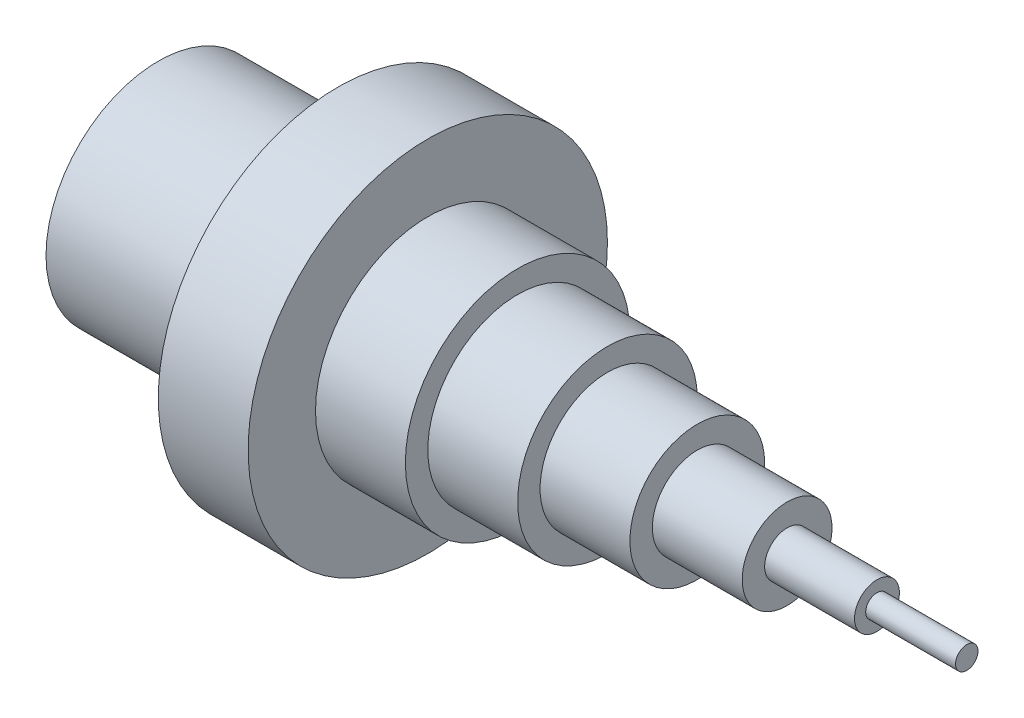
ISO-10303-21;
HEADER;
FILE_DESCRIPTION(('STEP AP214'),'2;1');
FILE_NAME('part.step','',(''),(''),'','','');
FILE_SCHEMA(('AUTOMOTIVE_DESIGN { 1 0 10303 214 1 1 1 1 }'));
ENDSEC;
DATA;
#1=APPLICATION_CONTEXT('core data for automotive mechanical design processes');
#2=APPLICATION_PROTOCOL_DEFINITION('international standard','automotive_design',2000,#1);
#3=PRODUCT_CONTEXT('',#1,'mechanical');
#4=PRODUCT('Part','Part','',(#3));
#5=PRODUCT_RELATED_PRODUCT_CATEGORY('part','',(#4));
#6=PRODUCT_DEFINITION_FORMATION('','',#4);
#7=PRODUCT_DEFINITION_CONTEXT('part definition',#1,'design');
#8=PRODUCT_DEFINITION('design','',#6,#7);
#9=PRODUCT_DEFINITION_SHAPE('','',#8);
#10=(LENGTH_UNIT() NAMED_UNIT(*) SI_UNIT(.MILLI.,.METRE.));
#11=(NAMED_UNIT(*) PLANE_ANGLE_UNIT() SI_UNIT($,.RADIAN.));
#12=(NAMED_UNIT(*) SI_UNIT($,.STERADIAN.) SOLID_ANGLE_UNIT());
#13=UNCERTAINTY_MEASURE_WITH_UNIT(LENGTH_MEASURE(1.E-05),#10,'distance_accuracy_value','');
#14=(GEOMETRIC_REPRESENTATION_CONTEXT(3) GLOBAL_UNCERTAINTY_ASSIGNED_CONTEXT((#13)) GLOBAL_UNIT_ASSIGNED_CONTEXT((#10,
#11,#12)) REPRESENTATION_CONTEXT('',''));
#15=CARTESIAN_POINT('',(0.,0.,0.));
#16=DIRECTION('',(0.,0.,1.));
#17=DIRECTION('',(1.,0.,0.));
#18=AXIS2_PLACEMENT_3D('',#15,#16,#17);
#19=CARTESIAN_POINT('',(-180.,0.,0.));
#20=DIRECTION('',(-1.,0.,0.));
#21=DIRECTION('',(0.,0.,1.));
#22=AXIS2_PLACEMENT_3D('',#19,#20,#21);
#23=PLANE('',#22);
#24=CARTESIAN_POINT('',(-180.,0.,0.));
#25=DIRECTION('',(1.,0.,0.));
#26=DIRECTION('',(0.,0.,-1.));
#27=AXIS2_PLACEMENT_3D('',#24,#25,#26);
#28=CIRCLE('',#27,25.);
#29=CARTESIAN_POINT('',(-180.,0.,-25.));
#30=VERTEX_POINT('',#29);
#31=EDGE_CURVE('E83',#30,#30,#28,.T.);
#32=ORIENTED_EDGE('',*,*,#31,.F.);
#33=EDGE_LOOP('',(#32));
#34=FACE_BOUND('',#33,.T.);
#35=ADVANCED_FACE('F31',(#34),#23,.T.);
#36=CARTESIAN_POINT('',(0.,0.,0.));
#37=DIRECTION('',(1.,0.,0.));
#38=DIRECTION('',(0.,0.,-1.));
#39=AXIS2_PLACEMENT_3D('',#36,#37,#38);
#40=PLANE('',#39);
#41=CARTESIAN_POINT('',(0.,0.,0.));
#42=DIRECTION('',(1.,0.,0.));
#43=DIRECTION('',(0.,0.,-1.));
#44=AXIS2_PLACEMENT_3D('',#41,#42,#43);
#45=CIRCLE('',#44,2.5);
#46=CARTESIAN_POINT('',(0.,0.,-2.5));
#47=VERTEX_POINT('',#46);
#48=EDGE_CURVE('E10',#47,#47,#45,.T.);
#49=ORIENTED_EDGE('',*,*,#48,.T.);
#50=EDGE_LOOP('',(#49));
#51=FACE_BOUND('',#50,.T.);
#52=ADVANCED_FACE('F91',(#51),#40,.T.);
#53=CARTESIAN_POINT('',(0.,0.,0.));
#54=DIRECTION('',(1.,0.,0.));
#55=DIRECTION('',(0.,0.,-1.));
#56=AXIS2_PLACEMENT_3D('',#53,#54,#55);
#57=CYLINDRICAL_SURFACE('',#56,2.5);
#58=CARTESIAN_POINT('',(-20.,0.,0.));
#59=DIRECTION('',(1.,0.,0.));
#60=DIRECTION('',(0.,0.,-1.));
#61=AXIS2_PLACEMENT_3D('',#58,#59,#60);
#62=CIRCLE('',#61,2.5);
#63=CARTESIAN_POINT('',(-20.,0.,-2.5));
#64=VERTEX_POINT('',#63);
#65=EDGE_CURVE('E37',#64,#64,#62,.T.);
#66=ORIENTED_EDGE('',*,*,#65,.T.);
#67=EDGE_LOOP('',(#66));
#68=FACE_BOUND('',#67,.T.);
#69=ORIENTED_EDGE('',*,*,#48,.F.);
#70=EDGE_LOOP('',(#69));
#71=FACE_BOUND('',#70,.T.);
#72=ADVANCED_FACE('F95',(#68,#71),#57,.T.);
#73=CARTESIAN_POINT('',(-20.,0.,0.));
#74=DIRECTION('',(1.,0.,0.));
#75=DIRECTION('',(0.,0.,-1.));
#76=AXIS2_PLACEMENT_3D('',#73,#74,#75);
#77=PLANE('',#76);
#78=CARTESIAN_POINT('',(-20.,0.,0.));
#79=DIRECTION('',(1.,0.,0.));
#80=DIRECTION('',(0.,0.,-1.));
#81=AXIS2_PLACEMENT_3D('',#78,#79,#80);
#82=CIRCLE('',#81,5.);
#83=CARTESIAN_POINT('',(-20.,0.,-5.));
#84=VERTEX_POINT('',#83);
#85=EDGE_CURVE('E41',#84,#84,#82,.T.);
#86=ORIENTED_EDGE('',*,*,#85,.T.);
#87=EDGE_LOOP('',(#86));
#88=FACE_BOUND('',#87,.T.);
#89=ORIENTED_EDGE('',*,*,#65,.F.);
#90=EDGE_LOOP('',(#89));
#91=FACE_BOUND('',#90,.T.);
#92=ADVANCED_FACE('F99',(#88,#91),#77,.T.);
#93=CARTESIAN_POINT('',(0.,0.,0.));
#94=DIRECTION('',(1.,0.,0.));
#95=DIRECTION('',(0.,0.,-1.));
#96=AXIS2_PLACEMENT_3D('',#93,#94,#95);
#97=CYLINDRICAL_SURFACE('',#96,5.);
#98=CARTESIAN_POINT('',(-40.,0.,0.));
#99=DIRECTION('',(1.,0.,0.));
#100=DIRECTION('',(0.,0.,-1.));
#101=AXIS2_PLACEMENT_3D('',#98,#99,#100);
#102=CIRCLE('',#101,5.);
#103=CARTESIAN_POINT('',(-40.,0.,-5.));
#104=VERTEX_POINT('',#103);
#105=EDGE_CURVE('E45',#104,#104,#102,.T.);
#106=ORIENTED_EDGE('',*,*,#105,.T.);
#107=EDGE_LOOP('',(#106));
#108=FACE_BOUND('',#107,.T.);
#109=ORIENTED_EDGE('',*,*,#85,.F.);
#110=EDGE_LOOP('',(#109));
#111=FACE_BOUND('',#110,.T.);
#112=ADVANCED_FACE('F104',(#108,#111),#97,.T.);
#113=CARTESIAN_POINT('',(-40.,0.,0.));
#114=DIRECTION('',(1.,0.,0.));
#115=DIRECTION('',(0.,0.,-1.));
#116=AXIS2_PLACEMENT_3D('',#113,#114,#115);
#117=PLANE('',#116);
#118=CARTESIAN_POINT('',(-40.,0.,0.));
#119=DIRECTION('',(1.,0.,0.));
#120=DIRECTION('',(0.,0.,-1.));
#121=AXIS2_PLACEMENT_3D('',#118,#119,#120);
#122=CIRCLE('',#121,9.99999999999999);
#123=CARTESIAN_POINT('',(-40.,0.,-9.99999999999999));
#124=VERTEX_POINT('',#123);
#125=EDGE_CURVE('E50',#124,#124,#122,.T.);
#126=ORIENTED_EDGE('',*,*,#125,.T.);
#127=EDGE_LOOP('',(#126));
#128=FACE_BOUND('',#127,.T.);
#129=ORIENTED_EDGE('',*,*,#105,.F.);
#130=EDGE_LOOP('',(#129));
#131=FACE_BOUND('',#130,.T.);
#132=ADVANCED_FACE('F108',(#128,#131),#117,.T.);
#133=CARTESIAN_POINT('',(0.,0.,0.));
#134=DIRECTION('',(1.,0.,0.));
#135=DIRECTION('',(0.,0.,-1.));
#136=AXIS2_PLACEMENT_3D('',#133,#134,#135);
#137=CYLINDRICAL_SURFACE('',#136,9.99999999999999);
#138=CARTESIAN_POINT('',(-60.,0.,0.));
#139=DIRECTION('',(1.,0.,0.));
#140=DIRECTION('',(0.,0.,-1.));
#141=AXIS2_PLACEMENT_3D('',#138,#139,#140);
#142=CIRCLE('',#141,9.99999999999999);
#143=CARTESIAN_POINT('',(-60.,0.,-9.99999999999999));
#144=VERTEX_POINT('',#143);
#145=EDGE_CURVE('E53',#144,#144,#142,.T.);
#146=ORIENTED_EDGE('',*,*,#145,.T.);
#147=EDGE_LOOP('',(#146));
#148=FACE_BOUND('',#147,.T.);
#149=ORIENTED_EDGE('',*,*,#125,.F.);
#150=EDGE_LOOP('',(#149));
#151=FACE_BOUND('',#150,.T.);
#152=ADVANCED_FACE('F112',(#148,#151),#137,.T.);
#153=CARTESIAN_POINT('',(-60.,0.,0.));
#154=DIRECTION('',(1.,0.,0.));
#155=DIRECTION('',(0.,0.,-1.));
#156=AXIS2_PLACEMENT_3D('',#153,#154,#155);
#157=PLANE('',#156);
#158=CARTESIAN_POINT('',(-60.,0.,0.));
#159=DIRECTION('',(1.,0.,0.));
#160=DIRECTION('',(0.,0.,-1.));
#161=AXIS2_PLACEMENT_3D('',#158,#159,#160);
#162=CIRCLE('',#161,15.);
#163=CARTESIAN_POINT('',(-60.,0.,-15.));
#164=VERTEX_POINT('',#163);
#165=EDGE_CURVE('E56',#164,#164,#162,.T.);
#166=ORIENTED_EDGE('',*,*,#165,.T.);
#167=EDGE_LOOP('',(#166));
#168=FACE_BOUND('',#167,.T.);
#169=ORIENTED_EDGE('',*,*,#145,.F.);
#170=EDGE_LOOP('',(#169));
#171=FACE_BOUND('',#170,.T.);
#172=ADVANCED_FACE('F116',(#168,#171),#157,.T.);
#173=CARTESIAN_POINT('',(0.,0.,0.));
#174=DIRECTION('',(1.,0.,0.));
#175=DIRECTION('',(0.,0.,-1.));
#176=AXIS2_PLACEMENT_3D('',#173,#174,#175);
#177=CYLINDRICAL_SURFACE('',#176,15.);
#178=CARTESIAN_POINT('',(-80.,0.,0.));
#179=DIRECTION('',(1.,0.,0.));
#180=DIRECTION('',(0.,0.,-1.));
#181=AXIS2_PLACEMENT_3D('',#178,#179,#180);
#182=CIRCLE('',#181,15.);
#183=CARTESIAN_POINT('',(-80.,0.,-15.));
#184=VERTEX_POINT('',#183);
#185=EDGE_CURVE('E59',#184,#184,#182,.T.);
#186=ORIENTED_EDGE('',*,*,#185,.T.);
#187=EDGE_LOOP('',(#186));
#188=FACE_BOUND('',#187,.T.);
#189=ORIENTED_EDGE('',*,*,#165,.F.);
#190=EDGE_LOOP('',(#189));
#191=FACE_BOUND('',#190,.T.);
#192=ADVANCED_FACE('F120',(#188,#191),#177,.T.);
#193=CARTESIAN_POINT('',(-80.,0.,0.));
#194=DIRECTION('',(1.,0.,0.));
#195=DIRECTION('',(0.,0.,-1.));
#196=AXIS2_PLACEMENT_3D('',#193,#194,#195);
#197=PLANE('',#196);
#198=CARTESIAN_POINT('',(-80.,0.,0.));
#199=DIRECTION('',(1.,0.,0.));
#200=DIRECTION('',(0.,0.,-1.));
#201=AXIS2_PLACEMENT_3D('',#198,#199,#200);
#202=CIRCLE('',#201,20.);
#203=CARTESIAN_POINT('',(-80.,0.,-20.));
#204=VERTEX_POINT('',#203);
#205=EDGE_CURVE('E62',#204,#204,#202,.T.);
#206=ORIENTED_EDGE('',*,*,#205,.T.);
#207=EDGE_LOOP('',(#206));
#208=FACE_BOUND('',#207,.T.);
#209=ORIENTED_EDGE('',*,*,#185,.F.);
#210=EDGE_LOOP('',(#209));
#211=FACE_BOUND('',#210,.T.);
#212=ADVANCED_FACE('F124',(#208,#211),#197,.T.);
#213=CARTESIAN_POINT('',(0.,0.,0.));
#214=DIRECTION('',(1.,0.,0.));
#215=DIRECTION('',(0.,0.,-1.));
#216=AXIS2_PLACEMENT_3D('',#213,#214,#215);
#217=CYLINDRICAL_SURFACE('',#216,20.);
#218=CARTESIAN_POINT('',(-100.,0.,0.));
#219=DIRECTION('',(1.,0.,0.));
#220=DIRECTION('',(0.,0.,-1.));
#221=AXIS2_PLACEMENT_3D('',#218,#219,#220);
#222=CIRCLE('',#221,20.);
#223=CARTESIAN_POINT('',(-100.,0.,-20.));
#224=VERTEX_POINT('',#223);
#225=EDGE_CURVE('E65',#224,#224,#222,.T.);
#226=ORIENTED_EDGE('',*,*,#225,.T.);
#227=EDGE_LOOP('',(#226));
#228=FACE_BOUND('',#227,.T.);
#229=ORIENTED_EDGE('',*,*,#205,.F.);
#230=EDGE_LOOP('',(#229));
#231=FACE_BOUND('',#230,.T.);
#232=ADVANCED_FACE('F128',(#228,#231),#217,.T.);
#233=CARTESIAN_POINT('',(-100.,0.,0.));
#234=DIRECTION('',(1.,0.,0.));
#235=DIRECTION('',(0.,0.,-1.));
#236=AXIS2_PLACEMENT_3D('',#233,#234,#235);
#237=PLANE('',#236);
#238=CARTESIAN_POINT('',(-100.,0.,0.));
#239=DIRECTION('',(1.,0.,0.));
#240=DIRECTION('',(0.,0.,-1.));
#241=AXIS2_PLACEMENT_3D('',#238,#239,#240);
#242=CIRCLE('',#241,25.);
#243=CARTESIAN_POINT('',(-100.,0.,-25.));
#244=VERTEX_POINT('',#243);
#245=EDGE_CURVE('E68',#244,#244,#242,.T.);
#246=ORIENTED_EDGE('',*,*,#245,.T.);
#247=EDGE_LOOP('',(#246));
#248=FACE_BOUND('',#247,.T.);
#249=ORIENTED_EDGE('',*,*,#225,.F.);
#250=EDGE_LOOP('',(#249));
#251=FACE_BOUND('',#250,.T.);
#252=ADVANCED_FACE('F132',(#248,#251),#237,.T.);
#253=CARTESIAN_POINT('',(0.,0.,0.));
#254=DIRECTION('',(1.,0.,0.));
#255=DIRECTION('',(0.,0.,-1.));
#256=AXIS2_PLACEMENT_3D('',#253,#254,#255);
#257=CYLINDRICAL_SURFACE('',#256,25.);
#258=CARTESIAN_POINT('',(-120.,0.,0.));
#259=DIRECTION('',(1.,0.,0.));
#260=DIRECTION('',(0.,0.,-1.));
#261=AXIS2_PLACEMENT_3D('',#258,#259,#260);
#262=CIRCLE('',#261,25.);
#263=CARTESIAN_POINT('',(-120.,0.,-25.));
#264=VERTEX_POINT('',#263);
#265=EDGE_CURVE('E71',#264,#264,#262,.T.);
#266=ORIENTED_EDGE('',*,*,#265,.T.);
#267=EDGE_LOOP('',(#266));
#268=FACE_BOUND('',#267,.T.);
#269=ORIENTED_EDGE('',*,*,#245,.F.);
#270=EDGE_LOOP('',(#269));
#271=FACE_BOUND('',#270,.T.);
#272=ADVANCED_FACE('F136',(#268,#271),#257,.T.);
#273=CARTESIAN_POINT('',(-120.,0.,0.));
#274=DIRECTION('',(1.,0.,0.));
#275=DIRECTION('',(0.,0.,-1.));
#276=AXIS2_PLACEMENT_3D('',#273,#274,#275);
#277=PLANE('',#276);
#278=CARTESIAN_POINT('',(-120.,0.,0.));
#279=DIRECTION('',(1.,0.,0.));
#280=DIRECTION('',(0.,0.,-1.));
#281=AXIS2_PLACEMENT_3D('',#278,#279,#280);
#282=CIRCLE('',#281,40.);
#283=CARTESIAN_POINT('',(-120.,0.,-40.));
#284=VERTEX_POINT('',#283);
#285=EDGE_CURVE('E74',#284,#284,#282,.T.);
#286=ORIENTED_EDGE('',*,*,#285,.T.);
#287=EDGE_LOOP('',(#286));
#288=FACE_BOUND('',#287,.T.);
#289=ORIENTED_EDGE('',*,*,#265,.F.);
#290=EDGE_LOOP('',(#289));
#291=FACE_BOUND('',#290,.T.);
#292=ADVANCED_FACE('F140',(#288,#291),#277,.T.);
#293=CARTESIAN_POINT('',(0.,0.,0.));
#294=DIRECTION('',(1.,0.,0.));
#295=DIRECTION('',(0.,0.,-1.));
#296=AXIS2_PLACEMENT_3D('',#293,#294,#295);
#297=CYLINDRICAL_SURFACE('',#296,40.);
#298=CARTESIAN_POINT('',(-140.,0.,0.));
#299=DIRECTION('',(1.,0.,0.));
#300=DIRECTION('',(0.,0.,-1.));
#301=AXIS2_PLACEMENT_3D('',#298,#299,#300);
#302=CIRCLE('',#301,40.);
#303=CARTESIAN_POINT('',(-140.,0.,-40.));
#304=VERTEX_POINT('',#303);
#305=EDGE_CURVE('E77',#304,#304,#302,.T.);
#306=ORIENTED_EDGE('',*,*,#305,.T.);
#307=EDGE_LOOP('',(#306));
#308=FACE_BOUND('',#307,.T.);
#309=ORIENTED_EDGE('',*,*,#285,.F.);
#310=EDGE_LOOP('',(#309));
#311=FACE_BOUND('',#310,.T.);
#312=ADVANCED_FACE('F144',(#308,#311),#297,.T.);
#313=CARTESIAN_POINT('',(-140.,0.,0.));
#314=DIRECTION('',(-1.,0.,0.));
#315=DIRECTION('',(0.,0.,1.));
#316=AXIS2_PLACEMENT_3D('',#313,#314,#315);
#317=PLANE('',#316);
#318=CARTESIAN_POINT('',(-140.,0.,0.));
#319=DIRECTION('',(1.,0.,0.));
#320=DIRECTION('',(0.,0.,-1.));
#321=AXIS2_PLACEMENT_3D('',#318,#319,#320);
#322=CIRCLE('',#321,25.);
#323=CARTESIAN_POINT('',(-140.,0.,-25.));
#324=VERTEX_POINT('',#323);
#325=EDGE_CURVE('E80',#324,#324,#322,.T.);
#326=ORIENTED_EDGE('',*,*,#325,.T.);
#327=EDGE_LOOP('',(#326));
#328=FACE_BOUND('',#327,.T.);
#329=ORIENTED_EDGE('',*,*,#305,.F.);
#330=EDGE_LOOP('',(#329));
#331=FACE_BOUND('',#330,.T.);
#332=ADVANCED_FACE('F148',(#328,#331),#317,.T.);
#333=CARTESIAN_POINT('',(0.,0.,0.));
#334=DIRECTION('',(1.,0.,0.));
#335=DIRECTION('',(0.,0.,-1.));
#336=AXIS2_PLACEMENT_3D('',#333,#334,#335);
#337=CYLINDRICAL_SURFACE('',#336,25.);
#338=ORIENTED_EDGE('',*,*,#31,.T.);
#339=EDGE_LOOP('',(#338));
#340=FACE_BOUND('',#339,.T.);
#341=ORIENTED_EDGE('',*,*,#325,.F.);
#342=EDGE_LOOP('',(#341));
#343=FACE_BOUND('',#342,.T.);
#344=ADVANCED_FACE('F87',(#340,#343),#337,.T.);
#345=CLOSED_SHELL('',(#35,#52,#72,#92,#112,#132,#152,#172,#192,#212,#232,#252,#272,#292,#312,
#332,#344));
#346=MANIFOLD_SOLID_BREP('B2',#345);
#347=ADVANCED_BREP_SHAPE_REPRESENTATION('',(#18,#346),#14);
#348=SHAPE_DEFINITION_REPRESENTATION(#9,#347);
ENDSEC;
END-ISO-10303-21;
